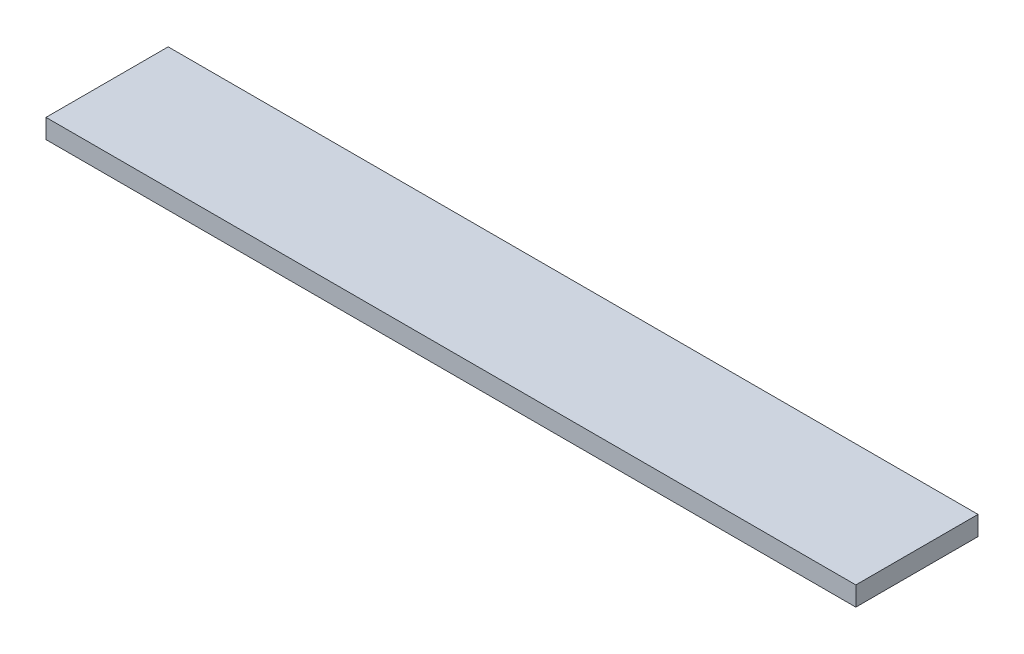
ISO-10303-21;
HEADER;
FILE_DESCRIPTION(('STEP AP214'),'2;1');
FILE_NAME('part.step','',(''),(''),'','','');
FILE_SCHEMA(('AUTOMOTIVE_DESIGN { 1 0 10303 214 1 1 1 1 }'));
ENDSEC;
DATA;
#1=APPLICATION_CONTEXT('core data for automotive mechanical design processes');
#2=APPLICATION_PROTOCOL_DEFINITION('international standard','automotive_design',2000,#1);
#3=PRODUCT_CONTEXT('',#1,'mechanical');
#4=PRODUCT('Part','Part','',(#3));
#5=PRODUCT_RELATED_PRODUCT_CATEGORY('part','',(#4));
#6=PRODUCT_DEFINITION_FORMATION('','',#4);
#7=PRODUCT_DEFINITION_CONTEXT('part definition',#1,'design');
#8=PRODUCT_DEFINITION('design','',#6,#7);
#9=PRODUCT_DEFINITION_SHAPE('','',#8);
#10=(LENGTH_UNIT() NAMED_UNIT(*) SI_UNIT(.MILLI.,.METRE.));
#11=(NAMED_UNIT(*) PLANE_ANGLE_UNIT() SI_UNIT($,.RADIAN.));
#12=(NAMED_UNIT(*) SI_UNIT($,.STERADIAN.) SOLID_ANGLE_UNIT());
#13=UNCERTAINTY_MEASURE_WITH_UNIT(LENGTH_MEASURE(1.E-05),#10,'distance_accuracy_value','');
#14=(GEOMETRIC_REPRESENTATION_CONTEXT(3) GLOBAL_UNCERTAINTY_ASSIGNED_CONTEXT((#13)) GLOBAL_UNIT_ASSIGNED_CONTEXT((#10,
#11,#12)) REPRESENTATION_CONTEXT('',''));
#15=CARTESIAN_POINT('',(0.,0.,0.));
#16=DIRECTION('',(0.,0.,1.));
#17=DIRECTION('',(1.,0.,0.));
#18=AXIS2_PLACEMENT_3D('',#15,#16,#17);
#19=CARTESIAN_POINT('',(0.,19.05,0.));
#20=DIRECTION('',(1.,0.,0.));
#21=DIRECTION('',(0.,0.,-1.));
#22=AXIS2_PLACEMENT_3D('',#19,#20,#21);
#23=PLANE('',#22);
#24=DIRECTION('',(0.,0.,1.));
#25=VECTOR('',#24,1.);
#26=CARTESIAN_POINT('',(0.,0.,0.));
#27=LINE('',#26,#25);
#28=CARTESIAN_POINT('',(0.,0.,-120.7008));
#29=VERTEX_POINT('',#28);
#30=CARTESIAN_POINT('',(0.,0.,0.));
#31=VERTEX_POINT('',#30);
#32=EDGE_CURVE('E102',#29,#31,#27,.T.);
#33=ORIENTED_EDGE('',*,*,#32,.T.);
#34=DIRECTION('',(0.,-1.,0.));
#35=VECTOR('',#34,1.);
#36=CARTESIAN_POINT('',(0.,19.05,0.));
#37=LINE('',#36,#35);
#38=CARTESIAN_POINT('',(0.,19.05,0.));
#39=VERTEX_POINT('',#38);
#40=EDGE_CURVE('E11',#39,#31,#37,.T.);
#41=ORIENTED_EDGE('',*,*,#40,.F.);
#42=DIRECTION('',(0.,0.,1.));
#43=VECTOR('',#42,1.);
#44=CARTESIAN_POINT('',(0.,19.05,0.));
#45=LINE('',#44,#43);
#46=CARTESIAN_POINT('',(0.,19.05,-120.7008));
#47=VERTEX_POINT('',#46);
#48=EDGE_CURVE('E90',#47,#39,#45,.T.);
#49=ORIENTED_EDGE('',*,*,#48,.F.);
#50=DIRECTION('',(0.,-1.,0.));
#51=VECTOR('',#50,1.);
#52=CARTESIAN_POINT('',(0.,19.05,-120.7008));
#53=LINE('',#52,#51);
#54=EDGE_CURVE('E98',#47,#29,#53,.T.);
#55=ORIENTED_EDGE('',*,*,#54,.T.);
#56=EDGE_LOOP('',(#33,#41,#49,#55));
#57=FACE_BOUND('',#56,.T.);
#58=ADVANCED_FACE('F39',(#57),#23,.F.);
#59=CARTESIAN_POINT('',(0.,19.05,0.));
#60=DIRECTION('',(0.,0.,-1.));
#61=DIRECTION('',(-1.,0.,0.));
#62=AXIS2_PLACEMENT_3D('',#59,#60,#61);
#63=PLANE('',#62);
#64=DIRECTION('',(1.,0.,0.));
#65=VECTOR('',#64,1.);
#66=CARTESIAN_POINT('',(0.,0.,0.));
#67=LINE('',#66,#65);
#68=CARTESIAN_POINT('',(800.1,0.,0.));
#69=VERTEX_POINT('',#68);
#70=EDGE_CURVE('E94',#31,#69,#67,.T.);
#71=ORIENTED_EDGE('',*,*,#70,.T.);
#72=DIRECTION('',(0.,-1.,0.));
#73=VECTOR('',#72,1.);
#74=CARTESIAN_POINT('',(800.1,19.05,0.));
#75=LINE('',#74,#73);
#76=CARTESIAN_POINT('',(800.1,19.05,0.));
#77=VERTEX_POINT('',#76);
#78=EDGE_CURVE('E47',#77,#69,#75,.T.);
#79=ORIENTED_EDGE('',*,*,#78,.F.);
#80=DIRECTION('',(1.,0.,0.));
#81=VECTOR('',#80,1.);
#82=CARTESIAN_POINT('',(0.,19.05,0.));
#83=LINE('',#82,#81);
#84=EDGE_CURVE('E85',#39,#77,#83,.T.);
#85=ORIENTED_EDGE('',*,*,#84,.F.);
#86=ORIENTED_EDGE('',*,*,#40,.T.);
#87=EDGE_LOOP('',(#71,#79,#85,#86));
#88=FACE_BOUND('',#87,.T.);
#89=ADVANCED_FACE('F93',(#88),#63,.F.);
#90=CARTESIAN_POINT('',(800.1,19.05,0.));
#91=DIRECTION('',(-1.,0.,0.));
#92=DIRECTION('',(0.,0.,1.));
#93=AXIS2_PLACEMENT_3D('',#90,#91,#92);
#94=PLANE('',#93);
#95=DIRECTION('',(0.,0.,-1.));
#96=VECTOR('',#95,1.);
#97=CARTESIAN_POINT('',(800.1,0.,0.));
#98=LINE('',#97,#96);
#99=CARTESIAN_POINT('',(800.1,0.,-120.7008));
#100=VERTEX_POINT('',#99);
#101=EDGE_CURVE('E72',#69,#100,#98,.T.);
#102=ORIENTED_EDGE('',*,*,#101,.T.);
#103=DIRECTION('',(0.,-1.,0.));
#104=VECTOR('',#103,1.);
#105=CARTESIAN_POINT('',(800.1,19.05,-120.7008));
#106=LINE('',#105,#104);
#107=CARTESIAN_POINT('',(800.1,19.05,-120.7008));
#108=VERTEX_POINT('',#107);
#109=EDGE_CURVE('E95',#108,#100,#106,.T.);
#110=ORIENTED_EDGE('',*,*,#109,.F.);
#111=DIRECTION('',(0.,0.,-1.));
#112=VECTOR('',#111,1.);
#113=CARTESIAN_POINT('',(800.1,19.05,0.));
#114=LINE('',#113,#112);
#115=EDGE_CURVE('E88',#77,#108,#114,.T.);
#116=ORIENTED_EDGE('',*,*,#115,.F.);
#117=ORIENTED_EDGE('',*,*,#78,.T.);
#118=EDGE_LOOP('',(#102,#110,#116,#117));
#119=FACE_BOUND('',#118,.T.);
#120=ADVANCED_FACE('F96',(#119),#94,.F.);
#121=CARTESIAN_POINT('',(0.,19.05,-120.7008));
#122=DIRECTION('',(0.,0.,1.));
#123=DIRECTION('',(1.,0.,0.));
#124=AXIS2_PLACEMENT_3D('',#121,#122,#123);
#125=PLANE('',#124);
#126=DIRECTION('',(-1.,0.,0.));
#127=VECTOR('',#126,1.);
#128=CARTESIAN_POINT('',(0.,0.,-120.7008));
#129=LINE('',#128,#127);
#130=EDGE_CURVE('E78',#100,#29,#129,.T.);
#131=ORIENTED_EDGE('',*,*,#130,.T.);
#132=ORIENTED_EDGE('',*,*,#54,.F.);
#133=DIRECTION('',(-1.,0.,0.));
#134=VECTOR('',#133,1.);
#135=CARTESIAN_POINT('',(0.,19.05,-120.7008));
#136=LINE('',#135,#134);
#137=EDGE_CURVE('E55',#108,#47,#136,.T.);
#138=ORIENTED_EDGE('',*,*,#137,.F.);
#139=ORIENTED_EDGE('',*,*,#109,.T.);
#140=EDGE_LOOP('',(#131,#132,#138,#139));
#141=FACE_BOUND('',#140,.T.);
#142=ADVANCED_FACE('F109',(#141),#125,.F.);
#143=CARTESIAN_POINT('',(0.,19.05,0.));
#144=DIRECTION('',(0.,-1.,0.));
#145=DIRECTION('',(0.,0.,-1.));
#146=AXIS2_PLACEMENT_3D('',#143,#144,#145);
#147=PLANE('',#146);
#148=ORIENTED_EDGE('',*,*,#48,.T.);
#149=ORIENTED_EDGE('',*,*,#84,.T.);
#150=ORIENTED_EDGE('',*,*,#115,.T.);
#151=ORIENTED_EDGE('',*,*,#137,.T.);
#152=EDGE_LOOP('',(#148,#149,#150,#151));
#153=FACE_BOUND('',#152,.T.);
#154=ADVANCED_FACE('F86',(#153),#147,.F.);
#155=CARTESIAN_POINT('',(0.,0.,0.));
#156=DIRECTION('',(0.,-1.,0.));
#157=DIRECTION('',(0.,0.,-1.));
#158=AXIS2_PLACEMENT_3D('',#155,#156,#157);
#159=PLANE('',#158);
#160=ORIENTED_EDGE('',*,*,#32,.F.);
#161=ORIENTED_EDGE('',*,*,#130,.F.);
#162=ORIENTED_EDGE('',*,*,#101,.F.);
#163=ORIENTED_EDGE('',*,*,#70,.F.);
#164=EDGE_LOOP('',(#160,#161,#162,#163));
#165=FACE_BOUND('',#164,.T.);
#166=ADVANCED_FACE('F112',(#165),#159,.T.);
#167=CLOSED_SHELL('',(#58,#89,#120,#142,#154,#166));
#168=MANIFOLD_SOLID_BREP('B2',#167);
#169=ADVANCED_BREP_SHAPE_REPRESENTATION('',(#18,#168),#14);
#170=SHAPE_DEFINITION_REPRESENTATION(#9,#169);
ENDSEC;
END-ISO-10303-21;
